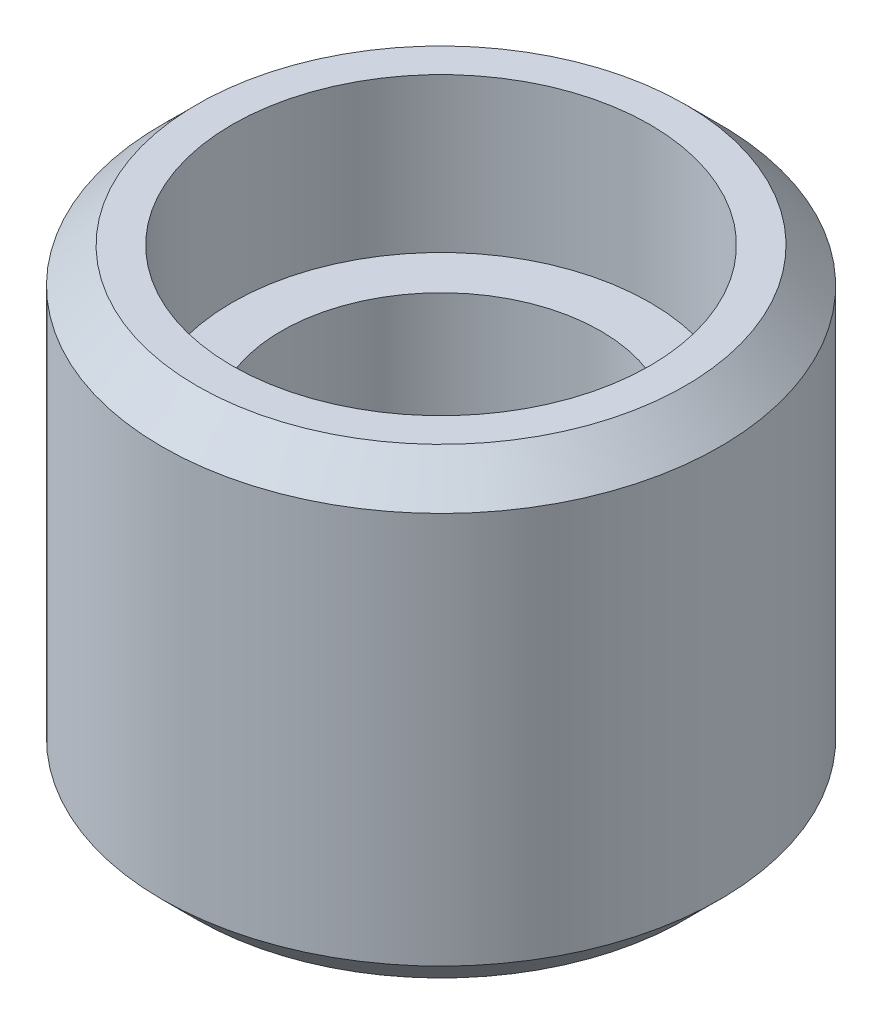
ISO-10303-21;
HEADER;
FILE_DESCRIPTION(('STEP AP214'),'2;1');
FILE_NAME('part.step','',(''),(''),'','','');
FILE_SCHEMA(('AUTOMOTIVE_DESIGN { 1 0 10303 214 1 1 1 1 }'));
ENDSEC;
DATA;
#1=APPLICATION_CONTEXT('core data for automotive mechanical design processes');
#2=APPLICATION_PROTOCOL_DEFINITION('international standard','automotive_design',2000,#1);
#3=PRODUCT_CONTEXT('',#1,'mechanical');
#4=PRODUCT('Part','Part','',(#3));
#5=PRODUCT_RELATED_PRODUCT_CATEGORY('part','',(#4));
#6=PRODUCT_DEFINITION_FORMATION('','',#4);
#7=PRODUCT_DEFINITION_CONTEXT('part definition',#1,'design');
#8=PRODUCT_DEFINITION('design','',#6,#7);
#9=PRODUCT_DEFINITION_SHAPE('','',#8);
#10=(LENGTH_UNIT() NAMED_UNIT(*) SI_UNIT(.MILLI.,.METRE.));
#11=(NAMED_UNIT(*) PLANE_ANGLE_UNIT() SI_UNIT($,.RADIAN.));
#12=(NAMED_UNIT(*) SI_UNIT($,.STERADIAN.) SOLID_ANGLE_UNIT());
#13=UNCERTAINTY_MEASURE_WITH_UNIT(LENGTH_MEASURE(1.E-05),#10,'distance_accuracy_value','');
#14=(GEOMETRIC_REPRESENTATION_CONTEXT(3) GLOBAL_UNCERTAINTY_ASSIGNED_CONTEXT((#13)) GLOBAL_UNIT_ASSIGNED_CONTEXT((#10,
#11,#12)) REPRESENTATION_CONTEXT('',''));
#15=CARTESIAN_POINT('',(0.,0.,0.));
#16=DIRECTION('',(0.,0.,1.));
#17=DIRECTION('',(1.,0.,0.));
#18=AXIS2_PLACEMENT_3D('',#15,#16,#17);
#19=CARTESIAN_POINT('',(0.,12.5,0.));
#20=DIRECTION('',(0.,-1.,0.));
#21=DIRECTION('',(0.,0.,1.));
#22=AXIS2_PLACEMENT_3D('',#19,#20,#21);
#23=PLANE('',#22);
#24=CARTESIAN_POINT('',(0.,12.5,0.));
#25=DIRECTION('',(0.,-1.,0.));
#26=DIRECTION('',(0.,0.,1.));
#27=AXIS2_PLACEMENT_3D('',#24,#25,#26);
#28=CIRCLE('',#27,12.95);
#29=CARTESIAN_POINT('',(0.,12.5,12.95));
#30=VERTEX_POINT('',#29);
#31=EDGE_CURVE('E56',#30,#30,#28,.T.);
#32=ORIENTED_EDGE('',*,*,#31,.F.);
#33=EDGE_LOOP('',(#32));
#34=FACE_BOUND('',#33,.T.);
#35=CARTESIAN_POINT('',(0.,12.5,0.));
#36=DIRECTION('',(0.,-1.,0.));
#37=DIRECTION('',(0.,0.,1.));
#38=AXIS2_PLACEMENT_3D('',#35,#36,#37);
#39=CIRCLE('',#38,16.95);
#40=CARTESIAN_POINT('',(0.,12.5,16.95));
#41=VERTEX_POINT('',#40);
#42=EDGE_CURVE('E52',#41,#41,#39,.T.);
#43=ORIENTED_EDGE('',*,*,#42,.T.);
#44=EDGE_LOOP('',(#43));
#45=FACE_BOUND('',#44,.T.);
#46=ADVANCED_FACE('F13',(#34,#45),#23,.T.);
#47=CARTESIAN_POINT('',(0.,25.,0.));
#48=DIRECTION('',(0.,-1.,0.));
#49=DIRECTION('',(0.,0.,1.));
#50=AXIS2_PLACEMENT_3D('',#47,#48,#49);
#51=PLANE('',#50);
#52=CARTESIAN_POINT('',(0.,25.,0.));
#53=DIRECTION('',(0.,-1.,0.));
#54=DIRECTION('',(0.,0.,1.));
#55=AXIS2_PLACEMENT_3D('',#52,#53,#54);
#56=CIRCLE('',#55,12.95);
#57=CARTESIAN_POINT('',(0.,25.,12.95));
#58=VERTEX_POINT('',#57);
#59=EDGE_CURVE('E16',#58,#58,#56,.T.);
#60=ORIENTED_EDGE('',*,*,#59,.T.);
#61=EDGE_LOOP('',(#60));
#62=FACE_BOUND('',#61,.T.);
#63=CARTESIAN_POINT('',(0.,25.,0.));
#64=DIRECTION('',(0.,-1.,0.));
#65=DIRECTION('',(0.,0.,1.));
#66=AXIS2_PLACEMENT_3D('',#63,#64,#65);
#67=CIRCLE('',#66,16.95);
#68=CARTESIAN_POINT('',(0.,25.,16.95));
#69=VERTEX_POINT('',#68);
#70=EDGE_CURVE('E9',#69,#69,#67,.T.);
#71=ORIENTED_EDGE('',*,*,#70,.F.);
#72=EDGE_LOOP('',(#71));
#73=FACE_BOUND('',#72,.T.);
#74=ADVANCED_FACE('F68',(#62,#73),#51,.F.);
#75=CARTESIAN_POINT('',(0.,18.75,0.));
#76=DIRECTION('',(0.,-1.,0.));
#77=DIRECTION('',(0.,0.,1.));
#78=AXIS2_PLACEMENT_3D('',#75,#76,#77);
#79=CYLINDRICAL_SURFACE('',#78,16.95);
#80=CARTESIAN_POINT('',(0.,37.5,0.));
#81=DIRECTION('',(0.,-1.,0.));
#82=DIRECTION('',(0.,0.,1.));
#83=AXIS2_PLACEMENT_3D('',#80,#81,#82);
#84=CIRCLE('',#83,16.95);
#85=CARTESIAN_POINT('',(0.,37.5,16.95));
#86=VERTEX_POINT('',#85);
#87=EDGE_CURVE('E21',#86,#86,#84,.T.);
#88=ORIENTED_EDGE('',*,*,#87,.F.);
#89=EDGE_LOOP('',(#88));
#90=FACE_BOUND('',#89,.T.);
#91=ORIENTED_EDGE('',*,*,#70,.T.);
#92=EDGE_LOOP('',(#91));
#93=FACE_BOUND('',#92,.T.);
#94=ADVANCED_FACE('F87',(#90,#93),#79,.F.);
#95=CARTESIAN_POINT('',(-16.95,37.5,0.));
#96=DIRECTION('',(0.,-1.,0.));
#97=DIRECTION('',(0.,0.,1.));
#98=AXIS2_PLACEMENT_3D('',#95,#96,#97);
#99=PLANE('',#98);
#100=CARTESIAN_POINT('',(0.,37.5,0.));
#101=DIRECTION('',(0.,-1.,0.));
#102=DIRECTION('',(0.,0.,1.));
#103=AXIS2_PLACEMENT_3D('',#100,#101,#102);
#104=CIRCLE('',#103,19.795);
#105=CARTESIAN_POINT('',(0.,37.5,19.795));
#106=VERTEX_POINT('',#105);
#107=EDGE_CURVE('E30',#106,#106,#104,.T.);
#108=ORIENTED_EDGE('',*,*,#107,.F.);
#109=EDGE_LOOP('',(#108));
#110=FACE_BOUND('',#109,.T.);
#111=ORIENTED_EDGE('',*,*,#87,.T.);
#112=EDGE_LOOP('',(#111));
#113=FACE_BOUND('',#112,.T.);
#114=ADVANCED_FACE('F94',(#110,#113),#99,.F.);
#115=CARTESIAN_POINT('',(0.,37.5,0.));
#116=DIRECTION('',(0.,-1.,0.));
#117=DIRECTION('',(0.,0.,1.));
#118=AXIS2_PLACEMENT_3D('',#115,#116,#117);
#119=CONICAL_SURFACE('',#118,19.795,0.78539816339745);
#120=CARTESIAN_POINT('',(0.,34.655,0.));
#121=DIRECTION('',(0.,-1.,0.));
#122=DIRECTION('',(0.,0.,1.));
#123=AXIS2_PLACEMENT_3D('',#120,#121,#122);
#124=CIRCLE('',#123,22.64);
#125=CARTESIAN_POINT('',(0.,34.655,22.64));
#126=VERTEX_POINT('',#125);
#127=EDGE_CURVE('E36',#126,#126,#124,.T.);
#128=ORIENTED_EDGE('',*,*,#127,.F.);
#129=EDGE_LOOP('',(#128));
#130=FACE_BOUND('',#129,.T.);
#131=ORIENTED_EDGE('',*,*,#107,.T.);
#132=EDGE_LOOP('',(#131));
#133=FACE_BOUND('',#132,.T.);
#134=ADVANCED_FACE('F100',(#130,#133),#119,.T.);
#135=CARTESIAN_POINT('',(0.,18.75,0.));
#136=DIRECTION('',(0.,-1.,0.));
#137=DIRECTION('',(0.,0.,1.));
#138=AXIS2_PLACEMENT_3D('',#135,#136,#137);
#139=CYLINDRICAL_SURFACE('',#138,22.64);
#140=CARTESIAN_POINT('',(0.,2.845,0.));
#141=DIRECTION('',(0.,-1.,0.));
#142=DIRECTION('',(0.,0.,1.));
#143=AXIS2_PLACEMENT_3D('',#140,#141,#142);
#144=CIRCLE('',#143,22.64);
#145=CARTESIAN_POINT('',(0.,2.845,22.64));
#146=VERTEX_POINT('',#145);
#147=EDGE_CURVE('E40',#146,#146,#144,.T.);
#148=ORIENTED_EDGE('',*,*,#147,.F.);
#149=EDGE_LOOP('',(#148));
#150=FACE_BOUND('',#149,.T.);
#151=ORIENTED_EDGE('',*,*,#127,.T.);
#152=EDGE_LOOP('',(#151));
#153=FACE_BOUND('',#152,.T.);
#154=ADVANCED_FACE('F104',(#150,#153),#139,.T.);
#155=CARTESIAN_POINT('',(0.,0.,0.));
#156=DIRECTION('',(0.,1.,0.));
#157=DIRECTION('',(0.,0.,-1.));
#158=AXIS2_PLACEMENT_3D('',#155,#156,#157);
#159=CONICAL_SURFACE('',#158,19.795,0.78539816339745);
#160=ORIENTED_EDGE('',*,*,#147,.T.);
#161=EDGE_LOOP('',(#160));
#162=FACE_BOUND('',#161,.T.);
#163=CARTESIAN_POINT('',(0.,0.,0.));
#164=DIRECTION('',(0.,-1.,0.));
#165=DIRECTION('',(0.,0.,1.));
#166=AXIS2_PLACEMENT_3D('',#163,#164,#165);
#167=CIRCLE('',#166,19.795);
#168=CARTESIAN_POINT('',(0.,0.,19.795));
#169=VERTEX_POINT('',#168);
#170=EDGE_CURVE('E44',#169,#169,#167,.T.);
#171=ORIENTED_EDGE('',*,*,#170,.F.);
#172=EDGE_LOOP('',(#171));
#173=FACE_BOUND('',#172,.T.);
#174=ADVANCED_FACE('F108',(#162,#173),#159,.T.);
#175=CARTESIAN_POINT('',(-16.95,0.,0.));
#176=DIRECTION('',(0.,-1.,0.));
#177=DIRECTION('',(0.,0.,1.));
#178=AXIS2_PLACEMENT_3D('',#175,#176,#177);
#179=PLANE('',#178);
#180=ORIENTED_EDGE('',*,*,#170,.T.);
#181=EDGE_LOOP('',(#180));
#182=FACE_BOUND('',#181,.T.);
#183=CARTESIAN_POINT('',(0.,0.,0.));
#184=DIRECTION('',(0.,-1.,0.));
#185=DIRECTION('',(0.,0.,1.));
#186=AXIS2_PLACEMENT_3D('',#183,#184,#185);
#187=CIRCLE('',#186,16.95);
#188=CARTESIAN_POINT('',(0.,0.,16.95));
#189=VERTEX_POINT('',#188);
#190=EDGE_CURVE('E48',#189,#189,#187,.T.);
#191=ORIENTED_EDGE('',*,*,#190,.F.);
#192=EDGE_LOOP('',(#191));
#193=FACE_BOUND('',#192,.T.);
#194=ADVANCED_FACE('F79',(#182,#193),#179,.T.);
#195=CARTESIAN_POINT('',(0.,18.75,0.));
#196=DIRECTION('',(0.,-1.,0.));
#197=DIRECTION('',(0.,0.,1.));
#198=AXIS2_PLACEMENT_3D('',#195,#196,#197);
#199=CYLINDRICAL_SURFACE('',#198,16.95);
#200=ORIENTED_EDGE('',*,*,#190,.T.);
#201=EDGE_LOOP('',(#200));
#202=FACE_BOUND('',#201,.T.);
#203=ORIENTED_EDGE('',*,*,#42,.F.);
#204=EDGE_LOOP('',(#203));
#205=FACE_BOUND('',#204,.T.);
#206=ADVANCED_FACE('F73',(#202,#205),#199,.F.);
#207=CARTESIAN_POINT('',(0.,0.,0.));
#208=DIRECTION('',(0.,1.,0.));
#209=DIRECTION('',(1.,0.,0.));
#210=AXIS2_PLACEMENT_3D('',#207,#208,#209);
#211=CYLINDRICAL_SURFACE('',#210,12.95);
#212=ORIENTED_EDGE('',*,*,#31,.T.);
#213=EDGE_LOOP('',(#212));
#214=FACE_BOUND('',#213,.T.);
#215=ORIENTED_EDGE('',*,*,#59,.F.);
#216=EDGE_LOOP('',(#215));
#217=FACE_BOUND('',#216,.T.);
#218=ADVANCED_FACE('F71',(#214,#217),#211,.F.);
#219=CLOSED_SHELL('',(#46,#74,#94,#114,#134,#154,#174,#194,#206,#218));
#220=MANIFOLD_SOLID_BREP('B1',#219);
#221=ADVANCED_BREP_SHAPE_REPRESENTATION('',(#18,#220),#14);
#222=SHAPE_DEFINITION_REPRESENTATION(#9,#221);
ENDSEC;
END-ISO-10303-21;
